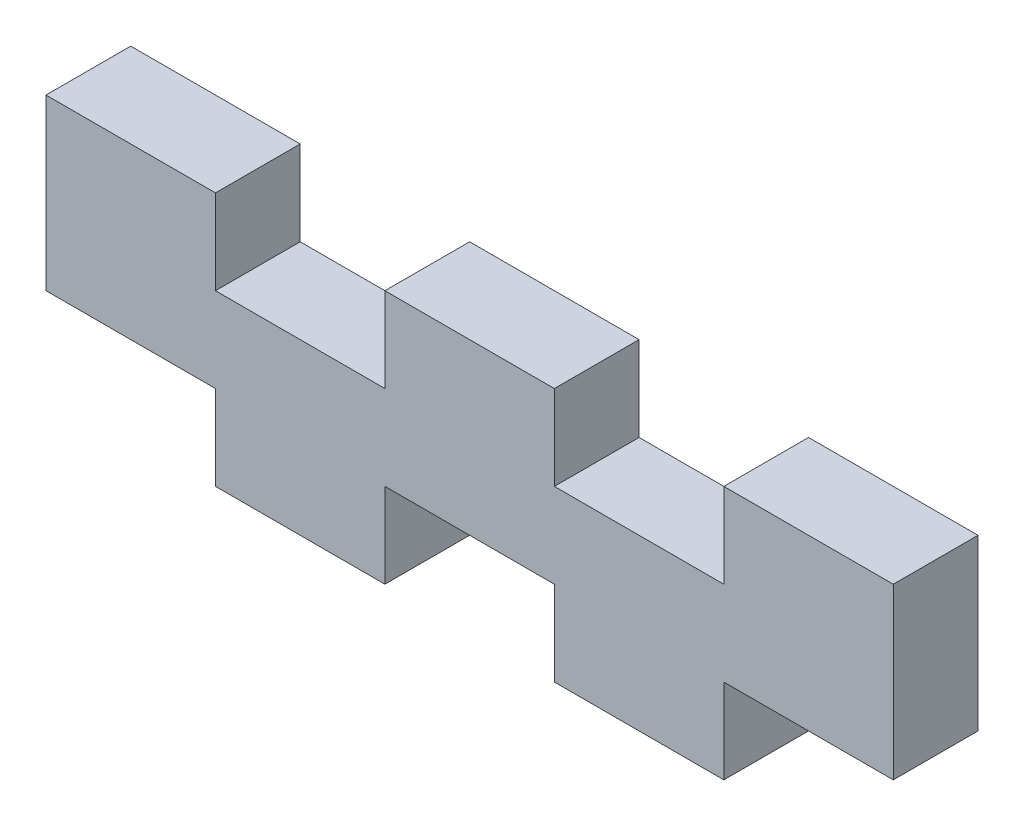
ISO-10303-21;
HEADER;
FILE_DESCRIPTION(('STEP AP214'),'2;1');
FILE_NAME('part.step','',(''),(''),'','','');
FILE_SCHEMA(('AUTOMOTIVE_DESIGN { 1 0 10303 214 1 1 1 1 }'));
ENDSEC;
DATA;
#1=APPLICATION_CONTEXT('core data for automotive mechanical design processes');
#2=APPLICATION_PROTOCOL_DEFINITION('international standard','automotive_design',2000,#1);
#3=PRODUCT_CONTEXT('',#1,'mechanical');
#4=PRODUCT('Part','Part','',(#3));
#5=PRODUCT_RELATED_PRODUCT_CATEGORY('part','',(#4));
#6=PRODUCT_DEFINITION_FORMATION('','',#4);
#7=PRODUCT_DEFINITION_CONTEXT('part definition',#1,'design');
#8=PRODUCT_DEFINITION('design','',#6,#7);
#9=PRODUCT_DEFINITION_SHAPE('','',#8);
#10=(LENGTH_UNIT() NAMED_UNIT(*) SI_UNIT(.MILLI.,.METRE.));
#11=(NAMED_UNIT(*) PLANE_ANGLE_UNIT() SI_UNIT($,.RADIAN.));
#12=(NAMED_UNIT(*) SI_UNIT($,.STERADIAN.) SOLID_ANGLE_UNIT());
#13=UNCERTAINTY_MEASURE_WITH_UNIT(LENGTH_MEASURE(1.E-05),#10,'distance_accuracy_value','');
#14=(GEOMETRIC_REPRESENTATION_CONTEXT(3) GLOBAL_UNCERTAINTY_ASSIGNED_CONTEXT((#13)) GLOBAL_UNIT_ASSIGNED_CONTEXT((#10,
#11,#12)) REPRESENTATION_CONTEXT('',''));
#15=CARTESIAN_POINT('',(0.,0.,0.));
#16=DIRECTION('',(0.,0.,1.));
#17=DIRECTION('',(1.,0.,0.));
#18=AXIS2_PLACEMENT_3D('',#15,#16,#17);
#19=CARTESIAN_POINT('',(0.,15.24,5.08000000000031));
#20=DIRECTION('',(0.,-1.,0.));
#21=DIRECTION('',(1.00000000000002,0.,0.));
#22=AXIS2_PLACEMENT_3D('',#19,#20,#21);
#23=PLANE('',#22);
#24=DIRECTION('',(-1.00000000000002,0.,0.));
#25=VECTOR('',#24,1.);
#26=CARTESIAN_POINT('',(0.,15.24,5.08000000000031));
#27=LINE('',#26,#25);
#28=CARTESIAN_POINT('',(10.1600000000002,15.24,5.0800000000002));
#29=VERTEX_POINT('',#28);
#30=CARTESIAN_POINT('',(0.,15.24,5.08000000000031));
#31=VERTEX_POINT('',#30);
#32=EDGE_CURVE('E212',#29,#31,#27,.T.);
#33=ORIENTED_EDGE('',*,*,#32,.F.);
#34=DIRECTION('',(0.,0.,1.00000000000002));
#35=VECTOR('',#34,1.);
#36=CARTESIAN_POINT('',(10.1600000000002,15.24,-0.000999999999862222));
#37=LINE('',#36,#35);
#38=CARTESIAN_POINT('',(10.1600000000002,15.24,2.22044604925031E-13));
#39=VERTEX_POINT('',#38);
#40=EDGE_CURVE('E179',#39,#29,#37,.T.);
#41=ORIENTED_EDGE('',*,*,#40,.F.);
#42=DIRECTION('',(-1.00000000000002,0.,0.));
#43=VECTOR('',#42,1.);
#44=CARTESIAN_POINT('',(0.,15.24,0.));
#45=LINE('',#44,#43);
#46=CARTESIAN_POINT('',(0.,15.24,0.));
#47=VERTEX_POINT('',#46);
#48=EDGE_CURVE('E195',#39,#47,#45,.T.);
#49=ORIENTED_EDGE('',*,*,#48,.T.);
#50=DIRECTION('',(0.,0.,-1.00000000000002));
#51=VECTOR('',#50,1.);
#52=CARTESIAN_POINT('',(0.,15.24,5.08000000000031));
#53=LINE('',#52,#51);
#54=EDGE_CURVE('E40',#31,#47,#53,.T.);
#55=ORIENTED_EDGE('',*,*,#54,.F.);
#56=EDGE_LOOP('',(#33,#41,#49,#55));
#57=FACE_BOUND('',#56,.T.);
#58=ADVANCED_FACE('F32',(#57),#23,.F.);
#59=CARTESIAN_POINT('',(30.4800000000005,15.2399999999999,1.94289029309402E-13));
#60=VERTEX_POINT('',#59);
#61=CARTESIAN_POINT('',(20.3200000000003,15.24,1.11022302462516E-13));
#62=VERTEX_POINT('',#61);
#63=EDGE_CURVE('E186',#60,#62,#45,.T.);
#64=ORIENTED_EDGE('',*,*,#63,.T.);
#65=DIRECTION('',(0.,0.,1.00000000000002));
#66=VECTOR('',#65,1.);
#67=CARTESIAN_POINT('',(20.3200000000003,15.24,-0.000999999999806711));
#68=LINE('',#67,#66);
#69=CARTESIAN_POINT('',(20.3200000000003,15.24,5.08000000000028));
#70=VERTEX_POINT('',#69);
#71=EDGE_CURVE('E168',#62,#70,#68,.T.);
#72=ORIENTED_EDGE('',*,*,#71,.T.);
#73=CARTESIAN_POINT('',(30.4800000000005,15.24,5.08000000000029));
#74=VERTEX_POINT('',#73);
#75=EDGE_CURVE('E210',#74,#70,#27,.T.);
#76=ORIENTED_EDGE('',*,*,#75,.F.);
#77=DIRECTION('',(0.,0.,1.00000000000002));
#78=VECTOR('',#77,1.);
#79=CARTESIAN_POINT('',(30.4800000000005,15.2399999999999,-0.001000000000001));
#80=LINE('',#79,#78);
#81=EDGE_CURVE('E193',#60,#74,#80,.T.);
#82=ORIENTED_EDGE('',*,*,#81,.F.);
#83=EDGE_LOOP('',(#64,#72,#76,#82));
#84=FACE_BOUND('',#83,.T.);
#85=ADVANCED_FACE('F192',(#84),#23,.F.);
#86=CARTESIAN_POINT('',(0.,0.,5.08000000000028));
#87=DIRECTION('',(0.,1.,0.));
#88=DIRECTION('',(0.,0.,1.00000000000002));
#89=AXIS2_PLACEMENT_3D('',#86,#87,#88);
#90=PLANE('',#89);
#91=DIRECTION('',(1.00000000000002,0.,0.));
#92=VECTOR('',#91,1.);
#93=CARTESIAN_POINT('',(0.,0.,5.08000000000028));
#94=LINE('',#93,#92);
#95=CARTESIAN_POINT('',(10.1600000000001,0.,5.08000000000006));
#96=VERTEX_POINT('',#95);
#97=CARTESIAN_POINT('',(20.3200000000004,0.,5.08000000000017));
#98=VERTEX_POINT('',#97);
#99=EDGE_CURVE('E222',#96,#98,#94,.T.);
#100=ORIENTED_EDGE('',*,*,#99,.F.);
#101=DIRECTION('',(0.,0.,-1.00000000000002));
#102=VECTOR('',#101,1.);
#103=CARTESIAN_POINT('',(10.1600000000002,0.,5.08100000000027));
#104=LINE('',#103,#102);
#105=CARTESIAN_POINT('',(10.1600000000002,0.,1.38777878078145E-13));
#106=VERTEX_POINT('',#105);
#107=EDGE_CURVE('E278',#96,#106,#104,.T.);
#108=ORIENTED_EDGE('',*,*,#107,.T.);
#109=DIRECTION('',(1.00000000000002,0.,0.));
#110=VECTOR('',#109,1.);
#111=CARTESIAN_POINT('',(0.,0.,0.));
#112=LINE('',#111,#110);
#113=CARTESIAN_POINT('',(20.3200000000004,0.,1.94289029309402E-13));
#114=VERTEX_POINT('',#113);
#115=EDGE_CURVE('E347',#106,#114,#112,.T.);
#116=ORIENTED_EDGE('',*,*,#115,.T.);
#117=DIRECTION('',(0.,0.,-1.00000000000002));
#118=VECTOR('',#117,1.);
#119=CARTESIAN_POINT('',(20.3200000000004,0.,5.08100000000014));
#120=LINE('',#119,#118);
#121=EDGE_CURVE('E254',#98,#114,#120,.T.);
#122=ORIENTED_EDGE('',*,*,#121,.F.);
#123=EDGE_LOOP('',(#100,#108,#116,#122));
#124=FACE_BOUND('',#123,.T.);
#125=ADVANCED_FACE('F345',(#124),#90,.F.);
#126=CARTESIAN_POINT('',(0.,0.,5.08000000000028));
#127=DIRECTION('',(1.00000000000002,0.,0.));
#128=DIRECTION('',(0.,0.,-1.00000000000002));
#129=AXIS2_PLACEMENT_3D('',#126,#127,#128);
#130=PLANE('',#129);
#131=DIRECTION('',(0.,-1.,0.));
#132=VECTOR('',#131,1.);
#133=CARTESIAN_POINT('',(0.,0.,0.));
#134=LINE('',#133,#132);
#135=CARTESIAN_POINT('',(0.,5.08,0.));
#136=VERTEX_POINT('',#135);
#137=EDGE_CURVE('E277',#47,#136,#134,.T.);
#138=ORIENTED_EDGE('',*,*,#137,.T.);
#139=DIRECTION('',(0.,0.,-1.00000000000002));
#140=VECTOR('',#139,1.);
#141=CARTESIAN_POINT('',(0.,5.08,5.08100000000028));
#142=LINE('',#141,#140);
#143=CARTESIAN_POINT('',(0.,5.08,5.08000000000028));
#144=VERTEX_POINT('',#143);
#145=EDGE_CURVE('E279',#144,#136,#142,.T.);
#146=ORIENTED_EDGE('',*,*,#145,.F.);
#147=DIRECTION('',(0.,-1.,0.));
#148=VECTOR('',#147,1.);
#149=CARTESIAN_POINT('',(0.,0.,5.08000000000028));
#150=LINE('',#149,#148);
#151=EDGE_CURVE('E198',#31,#144,#150,.T.);
#152=ORIENTED_EDGE('',*,*,#151,.F.);
#153=ORIENTED_EDGE('',*,*,#54,.T.);
#154=EDGE_LOOP('',(#138,#146,#152,#153));
#155=FACE_BOUND('',#154,.T.);
#156=ADVANCED_FACE('F34',(#155),#130,.F.);
#157=CARTESIAN_POINT('',(30.4800000000005,0.,5.0800000000002));
#158=VERTEX_POINT('',#157);
#159=CARTESIAN_POINT('',(40.6400000000007,0.,5.08000000000028));
#160=VERTEX_POINT('',#159);
#161=EDGE_CURVE('E227',#158,#160,#94,.T.);
#162=ORIENTED_EDGE('',*,*,#161,.F.);
#163=DIRECTION('',(0.,0.,-1.00000000000002));
#164=VECTOR('',#163,1.);
#165=CARTESIAN_POINT('',(30.4800000000006,0.,5.08100000000022));
#166=LINE('',#165,#164);
#167=CARTESIAN_POINT('',(30.4800000000005,0.,2.77555756156289E-13));
#168=VERTEX_POINT('',#167);
#169=EDGE_CURVE('E261',#158,#168,#166,.T.);
#170=ORIENTED_EDGE('',*,*,#169,.T.);
#171=CARTESIAN_POINT('',(40.6400000000007,0.,1.66533453693773E-13));
#172=VERTEX_POINT('',#171);
#173=EDGE_CURVE('E350',#168,#172,#112,.T.);
#174=ORIENTED_EDGE('',*,*,#173,.T.);
#175=DIRECTION('',(0.,0.,-1.00000000000002));
#176=VECTOR('',#175,1.);
#177=CARTESIAN_POINT('',(40.6400000000007,0.,5.08100000000022));
#178=LINE('',#177,#176);
#179=EDGE_CURVE('E232',#160,#172,#178,.T.);
#180=ORIENTED_EDGE('',*,*,#179,.F.);
#181=EDGE_LOOP('',(#162,#170,#174,#180));
#182=FACE_BOUND('',#181,.T.);
#183=ADVANCED_FACE('F356',(#182),#90,.F.);
#184=CARTESIAN_POINT('',(50.800000000001,0.,5.08000000000028));
#185=DIRECTION('',(-1.00000000000002,0.,0.));
#186=DIRECTION('',(0.,0.,1.00000000000002));
#187=AXIS2_PLACEMENT_3D('',#184,#185,#186);
#188=PLANE('',#187);
#189=DIRECTION('',(0.,1.,0.));
#190=VECTOR('',#189,1.);
#191=CARTESIAN_POINT('',(50.800000000001,0.,5.08000000000028));
#192=LINE('',#191,#190);
#193=CARTESIAN_POINT('',(50.800000000001,5.08000000000006,5.08000000000028));
#194=VERTEX_POINT('',#193);
#195=CARTESIAN_POINT('',(50.8000000000009,15.24,5.08000000000031));
#196=VERTEX_POINT('',#195);
#197=EDGE_CURVE('E218',#194,#196,#192,.T.);
#198=ORIENTED_EDGE('',*,*,#197,.F.);
#199=DIRECTION('',(0.,0.,-1.00000000000002));
#200=VECTOR('',#199,1.);
#201=CARTESIAN_POINT('',(50.8000000000009,5.08000000000006,5.0810000000002));
#202=LINE('',#201,#200);
#203=CARTESIAN_POINT('',(50.8000000000009,5.08000000000006,1.80411241501588E-13));
#204=VERTEX_POINT('',#203);
#205=EDGE_CURVE('E237',#194,#204,#202,.T.);
#206=ORIENTED_EDGE('',*,*,#205,.T.);
#207=DIRECTION('',(0.,1.,0.));
#208=VECTOR('',#207,1.);
#209=CARTESIAN_POINT('',(50.8000000000009,0.,1.80411241501588E-13));
#210=LINE('',#209,#208);
#211=CARTESIAN_POINT('',(50.8000000000008,15.24,1.11022302462516E-13));
#212=VERTEX_POINT('',#211);
#213=EDGE_CURVE('E199',#204,#212,#210,.T.);
#214=ORIENTED_EDGE('',*,*,#213,.T.);
#215=DIRECTION('',(0.,0.,-1.00000000000002));
#216=VECTOR('',#215,1.);
#217=CARTESIAN_POINT('',(50.8000000000009,15.24,5.08000000000031));
#218=LINE('',#217,#216);
#219=EDGE_CURVE('E11',#196,#212,#218,.T.);
#220=ORIENTED_EDGE('',*,*,#219,.F.);
#221=EDGE_LOOP('',(#198,#206,#214,#220));
#222=FACE_BOUND('',#221,.T.);
#223=ADVANCED_FACE('F393',(#222),#188,.F.);
#224=CARTESIAN_POINT('',(40.6400000000006,15.24,1.11022302462516E-13));
#225=VERTEX_POINT('',#224);
#226=EDGE_CURVE('E194',#212,#225,#45,.T.);
#227=ORIENTED_EDGE('',*,*,#226,.T.);
#228=DIRECTION('',(0.,0.,1.00000000000002));
#229=VECTOR('',#228,1.);
#230=CARTESIAN_POINT('',(40.6400000000007,15.24,-0.000999999999862222));
#231=LINE('',#230,#229);
#232=CARTESIAN_POINT('',(40.6400000000006,15.24,5.0800000000002));
#233=VERTEX_POINT('',#232);
#234=EDGE_CURVE('E298',#225,#233,#231,.T.);
#235=ORIENTED_EDGE('',*,*,#234,.T.);
#236=EDGE_CURVE('E203',#196,#233,#27,.T.);
#237=ORIENTED_EDGE('',*,*,#236,.F.);
#238=ORIENTED_EDGE('',*,*,#219,.T.);
#239=EDGE_LOOP('',(#227,#235,#237,#238));
#240=FACE_BOUND('',#239,.T.);
#241=ADVANCED_FACE('F386',(#240),#23,.F.);
#242=CARTESIAN_POINT('',(0.,0.,5.08000000000028));
#243=DIRECTION('',(0.,0.,-1.00000000000002));
#244=DIRECTION('',(-1.00000000000002,0.,0.));
#245=AXIS2_PLACEMENT_3D('',#242,#243,#244);
#246=PLANE('',#245);
#247=DIRECTION('',(1.00000000000002,0.,0.));
#248=VECTOR('',#247,1.);
#249=CARTESIAN_POINT('',(10.1600000000002,10.1599999999999,5.08000000000021));
#250=LINE('',#249,#248);
#251=CARTESIAN_POINT('',(10.1600000000002,10.1599999999999,5.08000000000021));
#252=VERTEX_POINT('',#251);
#253=CARTESIAN_POINT('',(20.3200000000004,10.16,5.08000000000024));
#254=VERTEX_POINT('',#253);
#255=EDGE_CURVE('E319',#252,#254,#250,.T.);
#256=ORIENTED_EDGE('',*,*,#255,.F.);
#257=DIRECTION('',(0.,-1.,0.));
#258=VECTOR('',#257,1.);
#259=CARTESIAN_POINT('',(10.1600000000002,15.24,5.0800000000002));
#260=LINE('',#259,#258);
#261=EDGE_CURVE('E321',#29,#252,#260,.T.);
#262=ORIENTED_EDGE('',*,*,#261,.F.);
#263=ORIENTED_EDGE('',*,*,#32,.T.);
#264=ORIENTED_EDGE('',*,*,#151,.T.);
#265=DIRECTION('',(-1.00000000000002,0.,0.));
#266=VECTOR('',#265,1.);
#267=CARTESIAN_POINT('',(0.,5.08,5.08000000000028));
#268=LINE('',#267,#266);
#269=CARTESIAN_POINT('',(10.1600000000001,5.08,5.08000000000014));
#270=VERTEX_POINT('',#269);
#271=EDGE_CURVE('E275',#270,#144,#268,.T.);
#272=ORIENTED_EDGE('',*,*,#271,.F.);
#273=DIRECTION('',(0.,1.,0.));
#274=VECTOR('',#273,1.);
#275=CARTESIAN_POINT('',(10.1600000000001,0.,5.08000000000006));
#276=LINE('',#275,#274);
#277=EDGE_CURVE('E253',#96,#270,#276,.T.);
#278=ORIENTED_EDGE('',*,*,#277,.F.);
#279=ORIENTED_EDGE('',*,*,#99,.T.);
#280=DIRECTION('',(0.,-1.,0.));
#281=VECTOR('',#280,1.);
#282=CARTESIAN_POINT('',(20.3200000000004,0.,5.08000000000017));
#283=LINE('',#282,#281);
#284=CARTESIAN_POINT('',(20.3200000000003,5.08,5.08000000000017));
#285=VERTEX_POINT('',#284);
#286=EDGE_CURVE('E271',#285,#98,#283,.T.);
#287=ORIENTED_EDGE('',*,*,#286,.F.);
#288=DIRECTION('',(-1.00000000000002,0.,0.));
#289=VECTOR('',#288,1.);
#290=CARTESIAN_POINT('',(20.3200000000003,5.08,5.08000000000017));
#291=LINE('',#290,#289);
#292=CARTESIAN_POINT('',(30.4800000000005,5.08000000000006,5.0800000000002));
#293=VERTEX_POINT('',#292);
#294=EDGE_CURVE('E250',#293,#285,#291,.T.);
#295=ORIENTED_EDGE('',*,*,#294,.F.);
#296=DIRECTION('',(0.,1.,0.));
#297=VECTOR('',#296,1.);
#298=CARTESIAN_POINT('',(30.4800000000005,0.,5.0800000000002));
#299=LINE('',#298,#297);
#300=EDGE_CURVE('E240',#158,#293,#299,.T.);
#301=ORIENTED_EDGE('',*,*,#300,.F.);
#302=ORIENTED_EDGE('',*,*,#161,.T.);
#303=DIRECTION('',(0.,-1.,0.));
#304=VECTOR('',#303,1.);
#305=CARTESIAN_POINT('',(40.6400000000007,0.,5.08000000000028));
#306=LINE('',#305,#304);
#307=CARTESIAN_POINT('',(40.6400000000007,5.07999999999999,5.08000000000028));
#308=VERTEX_POINT('',#307);
#309=EDGE_CURVE('E248',#308,#160,#306,.T.);
#310=ORIENTED_EDGE('',*,*,#309,.F.);
#311=DIRECTION('',(-1.00000000000002,0.,0.));
#312=VECTOR('',#311,1.);
#313=CARTESIAN_POINT('',(50.800000000001,5.08000000000006,5.08000000000028));
#314=LINE('',#313,#312);
#315=EDGE_CURVE('E245',#194,#308,#314,.T.);
#316=ORIENTED_EDGE('',*,*,#315,.F.);
#317=ORIENTED_EDGE('',*,*,#197,.T.);
#318=ORIENTED_EDGE('',*,*,#236,.T.);
#319=DIRECTION('',(0.,1.,0.));
#320=VECTOR('',#319,1.);
#321=CARTESIAN_POINT('',(40.6400000000006,15.24,5.0800000000002));
#322=LINE('',#321,#320);
#323=CARTESIAN_POINT('',(40.6400000000006,10.16,5.0800000000002));
#324=VERTEX_POINT('',#323);
#325=EDGE_CURVE('E296',#324,#233,#322,.T.);
#326=ORIENTED_EDGE('',*,*,#325,.F.);
#327=DIRECTION('',(1.00000000000002,0.,0.));
#328=VECTOR('',#327,1.);
#329=CARTESIAN_POINT('',(30.4800000000006,10.16,5.08000000000025));
#330=LINE('',#329,#328);
#331=CARTESIAN_POINT('',(30.4800000000006,10.16,5.08000000000025));
#332=VERTEX_POINT('',#331);
#333=EDGE_CURVE('E303',#332,#324,#330,.T.);
#334=ORIENTED_EDGE('',*,*,#333,.F.);
#335=DIRECTION('',(0.,-1.,0.));
#336=VECTOR('',#335,1.);
#337=CARTESIAN_POINT('',(30.4800000000005,15.24,5.08000000000029));
#338=LINE('',#337,#336);
#339=EDGE_CURVE('E305',#74,#332,#338,.T.);
#340=ORIENTED_EDGE('',*,*,#339,.F.);
#341=ORIENTED_EDGE('',*,*,#75,.T.);
#342=DIRECTION('',(0.,1.,0.));
#343=VECTOR('',#342,1.);
#344=CARTESIAN_POINT('',(20.3200000000003,15.24,5.08000000000028));
#345=LINE('',#344,#343);
#346=EDGE_CURVE('E174',#254,#70,#345,.T.);
#347=ORIENTED_EDGE('',*,*,#346,.F.);
#348=EDGE_LOOP('',(#256,#262,#263,#264,#272,#278,#279,#287,#295,#301,#302,#310,#316,#317,#318,
#326,#334,#340,#341,#347));
#349=FACE_BOUND('',#348,.T.);
#350=ADVANCED_FACE('F333',(#349),#246,.F.);
#351=CARTESIAN_POINT('',(0.,0.,0.));
#352=DIRECTION('',(0.,0.,-1.00000000000002));
#353=DIRECTION('',(-1.00000000000002,0.,0.));
#354=AXIS2_PLACEMENT_3D('',#351,#352,#353);
#355=PLANE('',#354);
#356=DIRECTION('',(0.,-1.,0.));
#357=VECTOR('',#356,1.);
#358=CARTESIAN_POINT('',(10.1600000000002,15.24,2.22044604925031E-13));
#359=LINE('',#358,#357);
#360=CARTESIAN_POINT('',(10.1600000000001,10.16,0.));
#361=VERTEX_POINT('',#360);
#362=EDGE_CURVE('E188',#39,#361,#359,.T.);
#363=ORIENTED_EDGE('',*,*,#362,.T.);
#364=DIRECTION('',(1.00000000000002,0.,0.));
#365=VECTOR('',#364,1.);
#366=CARTESIAN_POINT('',(10.1600000000001,10.16,0.));
#367=LINE('',#366,#365);
#368=CARTESIAN_POINT('',(20.3200000000004,10.16,1.94289029309402E-13));
#369=VERTEX_POINT('',#368);
#370=EDGE_CURVE('E187',#361,#369,#367,.T.);
#371=ORIENTED_EDGE('',*,*,#370,.T.);
#372=DIRECTION('',(0.,1.,0.));
#373=VECTOR('',#372,1.);
#374=CARTESIAN_POINT('',(20.3200000000003,15.24,1.11022302462516E-13));
#375=LINE('',#374,#373);
#376=EDGE_CURVE('E171',#369,#62,#375,.T.);
#377=ORIENTED_EDGE('',*,*,#376,.T.);
#378=ORIENTED_EDGE('',*,*,#63,.F.);
#379=DIRECTION('',(0.,-1.,0.));
#380=VECTOR('',#379,1.);
#381=CARTESIAN_POINT('',(30.4800000000005,15.2399999999999,1.94289029309402E-13));
#382=LINE('',#381,#380);
#383=CARTESIAN_POINT('',(30.4800000000005,10.1600000000001,1.94289029309402E-13));
#384=VERTEX_POINT('',#383);
#385=EDGE_CURVE('E308',#60,#384,#382,.T.);
#386=ORIENTED_EDGE('',*,*,#385,.T.);
#387=DIRECTION('',(1.00000000000002,0.,0.));
#388=VECTOR('',#387,1.);
#389=CARTESIAN_POINT('',(30.4800000000005,10.1600000000001,1.94289029309402E-13));
#390=LINE('',#389,#388);
#391=CARTESIAN_POINT('',(40.6400000000006,10.16,1.11022302462516E-13));
#392=VERTEX_POINT('',#391);
#393=EDGE_CURVE('E189',#384,#392,#390,.T.);
#394=ORIENTED_EDGE('',*,*,#393,.T.);
#395=DIRECTION('',(0.,1.,0.));
#396=VECTOR('',#395,1.);
#397=CARTESIAN_POINT('',(40.6400000000006,15.24,1.11022302462516E-13));
#398=LINE('',#397,#396);
#399=EDGE_CURVE('E310',#392,#225,#398,.T.);
#400=ORIENTED_EDGE('',*,*,#399,.T.);
#401=ORIENTED_EDGE('',*,*,#226,.F.);
#402=ORIENTED_EDGE('',*,*,#213,.F.);
#403=DIRECTION('',(1.00000000000002,0.,0.));
#404=VECTOR('',#403,1.);
#405=CARTESIAN_POINT('',(50.8000000000009,5.08000000000006,1.80411241501588E-13));
#406=LINE('',#405,#404);
#407=CARTESIAN_POINT('',(40.6400000000007,5.07999999999999,1.66533453693773E-13));
#408=VERTEX_POINT('',#407);
#409=EDGE_CURVE('E235',#408,#204,#406,.T.);
#410=ORIENTED_EDGE('',*,*,#409,.F.);
#411=DIRECTION('',(0.,1.,0.));
#412=VECTOR('',#411,1.);
#413=CARTESIAN_POINT('',(40.6400000000007,0.,1.66533453693773E-13));
#414=LINE('',#413,#412);
#415=EDGE_CURVE('E242',#172,#408,#414,.T.);
#416=ORIENTED_EDGE('',*,*,#415,.F.);
#417=ORIENTED_EDGE('',*,*,#173,.F.);
#418=DIRECTION('',(0.,-1.,0.));
#419=VECTOR('',#418,1.);
#420=CARTESIAN_POINT('',(30.4800000000005,0.,2.77555756156289E-13));
#421=LINE('',#420,#419);
#422=CARTESIAN_POINT('',(30.4800000000005,5.08000000000006,2.77555756156289E-13));
#423=VERTEX_POINT('',#422);
#424=EDGE_CURVE('E259',#423,#168,#421,.T.);
#425=ORIENTED_EDGE('',*,*,#424,.F.);
#426=DIRECTION('',(1.00000000000002,0.,0.));
#427=VECTOR('',#426,1.);
#428=CARTESIAN_POINT('',(20.3200000000004,5.08,1.66533453693773E-13));
#429=LINE('',#428,#427);
#430=CARTESIAN_POINT('',(20.3200000000004,5.08,1.66533453693773E-13));
#431=VERTEX_POINT('',#430);
#432=EDGE_CURVE('E266',#431,#423,#429,.T.);
#433=ORIENTED_EDGE('',*,*,#432,.F.);
#434=DIRECTION('',(0.,1.,0.));
#435=VECTOR('',#434,1.);
#436=CARTESIAN_POINT('',(20.3200000000004,0.,1.94289029309402E-13));
#437=LINE('',#436,#435);
#438=EDGE_CURVE('E269',#114,#431,#437,.T.);
#439=ORIENTED_EDGE('',*,*,#438,.F.);
#440=ORIENTED_EDGE('',*,*,#115,.F.);
#441=DIRECTION('',(0.,-1.,0.));
#442=VECTOR('',#441,1.);
#443=CARTESIAN_POINT('',(10.1600000000002,0.,1.38777878078145E-13));
#444=LINE('',#443,#442);
#445=CARTESIAN_POINT('',(10.1600000000001,5.08,0.));
#446=VERTEX_POINT('',#445);
#447=EDGE_CURVE('E282',#446,#106,#444,.T.);
#448=ORIENTED_EDGE('',*,*,#447,.F.);
#449=DIRECTION('',(1.00000000000002,0.,0.));
#450=VECTOR('',#449,1.);
#451=CARTESIAN_POINT('',(0.,5.08,0.));
#452=LINE('',#451,#450);
#453=EDGE_CURVE('E287',#136,#446,#452,.T.);
#454=ORIENTED_EDGE('',*,*,#453,.F.);
#455=ORIENTED_EDGE('',*,*,#137,.F.);
#456=ORIENTED_EDGE('',*,*,#48,.F.);
#457=EDGE_LOOP('',(#363,#371,#377,#378,#386,#394,#400,#401,#402,#410,#416,#417,#425,#433,#439,
#440,#448,#454,#455,#456));
#458=FACE_BOUND('',#457,.T.);
#459=ADVANCED_FACE('F184',(#458),#355,.T.);
#460=CARTESIAN_POINT('',(50.8000000000009,5.08000000000006,5.0810000000002));
#461=DIRECTION('',(0.,1.,0.));
#462=DIRECTION('',(-1.00000000000002,0.,0.));
#463=AXIS2_PLACEMENT_3D('',#460,#461,#462);
#464=PLANE('',#463);
#465=ORIENTED_EDGE('',*,*,#315,.T.);
#466=DIRECTION('',(0.,0.,-1.00000000000002));
#467=VECTOR('',#466,1.);
#468=CARTESIAN_POINT('',(40.6400000000007,5.07999999999999,5.08100000000022));
#469=LINE('',#468,#467);
#470=EDGE_CURVE('E234',#308,#408,#469,.T.);
#471=ORIENTED_EDGE('',*,*,#470,.T.);
#472=ORIENTED_EDGE('',*,*,#409,.T.);
#473=ORIENTED_EDGE('',*,*,#205,.F.);
#474=EDGE_LOOP('',(#465,#471,#472,#473));
#475=FACE_BOUND('',#474,.T.);
#476=ADVANCED_FACE('F380',(#475),#464,.F.);
#477=CARTESIAN_POINT('',(40.6400000000007,0.,5.08100000000022));
#478=DIRECTION('',(-1.00000000000002,0.,0.));
#479=DIRECTION('',(0.,0.,1.00000000000002));
#480=AXIS2_PLACEMENT_3D('',#477,#478,#479);
#481=PLANE('',#480);
#482=ORIENTED_EDGE('',*,*,#309,.T.);
#483=ORIENTED_EDGE('',*,*,#179,.T.);
#484=ORIENTED_EDGE('',*,*,#415,.T.);
#485=ORIENTED_EDGE('',*,*,#470,.F.);
#486=EDGE_LOOP('',(#482,#483,#484,#485));
#487=FACE_BOUND('',#486,.T.);
#488=ADVANCED_FACE('F362',(#487),#481,.F.);
#489=CARTESIAN_POINT('',(20.3200000000004,0.,5.08100000000014));
#490=DIRECTION('',(-1.00000000000002,0.,0.));
#491=DIRECTION('',(0.,0.,1.00000000000002));
#492=AXIS2_PLACEMENT_3D('',#489,#490,#491);
#493=PLANE('',#492);
#494=ORIENTED_EDGE('',*,*,#286,.T.);
#495=ORIENTED_EDGE('',*,*,#121,.T.);
#496=ORIENTED_EDGE('',*,*,#438,.T.);
#497=DIRECTION('',(0.,0.,-1.00000000000002));
#498=VECTOR('',#497,1.);
#499=CARTESIAN_POINT('',(20.3200000000004,5.08,5.08100000000025));
#500=LINE('',#499,#498);
#501=EDGE_CURVE('E255',#285,#431,#500,.T.);
#502=ORIENTED_EDGE('',*,*,#501,.F.);
#503=EDGE_LOOP('',(#494,#495,#496,#502));
#504=FACE_BOUND('',#503,.T.);
#505=ADVANCED_FACE('F372',(#504),#493,.F.);
#506=CARTESIAN_POINT('',(30.4800000000006,0.,5.08100000000022));
#507=DIRECTION('',(1.00000000000002,0.,0.));
#508=DIRECTION('',(0.,0.,-1.00000000000002));
#509=AXIS2_PLACEMENT_3D('',#506,#507,#508);
#510=PLANE('',#509);
#511=ORIENTED_EDGE('',*,*,#300,.T.);
#512=DIRECTION('',(0.,0.,-1.00000000000002));
#513=VECTOR('',#512,1.);
#514=CARTESIAN_POINT('',(30.4800000000005,5.08000000000006,5.08100000000022));
#515=LINE('',#514,#513);
#516=EDGE_CURVE('E258',#293,#423,#515,.T.);
#517=ORIENTED_EDGE('',*,*,#516,.T.);
#518=ORIENTED_EDGE('',*,*,#424,.T.);
#519=ORIENTED_EDGE('',*,*,#169,.F.);
#520=EDGE_LOOP('',(#511,#517,#518,#519));
#521=FACE_BOUND('',#520,.T.);
#522=ADVANCED_FACE('F368',(#521),#510,.F.);
#523=CARTESIAN_POINT('',(20.3200000000004,5.08,5.08100000000025));
#524=DIRECTION('',(0.,1.,0.));
#525=DIRECTION('',(-1.00000000000002,0.,0.));
#526=AXIS2_PLACEMENT_3D('',#523,#524,#525);
#527=PLANE('',#526);
#528=ORIENTED_EDGE('',*,*,#294,.T.);
#529=ORIENTED_EDGE('',*,*,#501,.T.);
#530=ORIENTED_EDGE('',*,*,#432,.T.);
#531=ORIENTED_EDGE('',*,*,#516,.F.);
#532=EDGE_LOOP('',(#528,#529,#530,#531));
#533=FACE_BOUND('',#532,.T.);
#534=ADVANCED_FACE('F370',(#533),#527,.F.);
#535=CARTESIAN_POINT('',(10.1600000000002,0.,5.08100000000027));
#536=DIRECTION('',(1.00000000000002,0.,0.));
#537=DIRECTION('',(0.,0.,-1.00000000000002));
#538=AXIS2_PLACEMENT_3D('',#535,#536,#537);
#539=PLANE('',#538);
#540=ORIENTED_EDGE('',*,*,#277,.T.);
#541=DIRECTION('',(0.,0.,-1.00000000000002));
#542=VECTOR('',#541,1.);
#543=CARTESIAN_POINT('',(10.1600000000002,5.08,5.08100000000024));
#544=LINE('',#543,#542);
#545=EDGE_CURVE('E281',#270,#446,#544,.T.);
#546=ORIENTED_EDGE('',*,*,#545,.T.);
#547=ORIENTED_EDGE('',*,*,#447,.T.);
#548=ORIENTED_EDGE('',*,*,#107,.F.);
#549=EDGE_LOOP('',(#540,#546,#547,#548));
#550=FACE_BOUND('',#549,.T.);
#551=ADVANCED_FACE('F341',(#550),#539,.F.);
#552=CARTESIAN_POINT('',(0.,5.08,5.08100000000028));
#553=DIRECTION('',(0.,1.,0.));
#554=DIRECTION('',(-1.00000000000002,0.,0.));
#555=AXIS2_PLACEMENT_3D('',#552,#553,#554);
#556=PLANE('',#555);
#557=ORIENTED_EDGE('',*,*,#271,.T.);
#558=ORIENTED_EDGE('',*,*,#145,.T.);
#559=ORIENTED_EDGE('',*,*,#453,.T.);
#560=ORIENTED_EDGE('',*,*,#545,.F.);
#561=EDGE_LOOP('',(#557,#558,#559,#560));
#562=FACE_BOUND('',#561,.T.);
#563=ADVANCED_FACE('F337',(#562),#556,.F.);
#564=CARTESIAN_POINT('',(30.4800000000005,15.2399999999999,-0.001000000000001));
#565=DIRECTION('',(-1.00000000000002,0.,0.));
#566=DIRECTION('',(0.,0.,1.00000000000002));
#567=AXIS2_PLACEMENT_3D('',#564,#565,#566);
#568=PLANE('',#567);
#569=ORIENTED_EDGE('',*,*,#81,.T.);
#570=ORIENTED_EDGE('',*,*,#339,.T.);
#571=DIRECTION('',(0.,0.,1.00000000000002));
#572=VECTOR('',#571,1.);
#573=CARTESIAN_POINT('',(30.4800000000005,10.1600000000001,-0.001000000000001));
#574=LINE('',#573,#572);
#575=EDGE_CURVE('E294',#384,#332,#574,.T.);
#576=ORIENTED_EDGE('',*,*,#575,.F.);
#577=ORIENTED_EDGE('',*,*,#385,.F.);
#578=EDGE_LOOP('',(#569,#570,#576,#577));
#579=FACE_BOUND('',#578,.T.);
#580=ADVANCED_FACE('F409',(#579),#568,.F.);
#581=CARTESIAN_POINT('',(40.6400000000007,15.24,-0.000999999999862222));
#582=DIRECTION('',(1.00000000000002,0.,0.));
#583=DIRECTION('',(0.,0.,-1.00000000000002));
#584=AXIS2_PLACEMENT_3D('',#581,#582,#583);
#585=PLANE('',#584);
#586=DIRECTION('',(0.,0.,1.00000000000002));
#587=VECTOR('',#586,1.);
#588=CARTESIAN_POINT('',(40.6400000000007,10.16,-0.000999999999862222));
#589=LINE('',#588,#587);
#590=EDGE_CURVE('E55',#392,#324,#589,.T.);
#591=ORIENTED_EDGE('',*,*,#590,.T.);
#592=ORIENTED_EDGE('',*,*,#325,.T.);
#593=ORIENTED_EDGE('',*,*,#234,.F.);
#594=ORIENTED_EDGE('',*,*,#399,.F.);
#595=EDGE_LOOP('',(#591,#592,#593,#594));
#596=FACE_BOUND('',#595,.T.);
#597=ADVANCED_FACE('F403',(#596),#585,.F.);
#598=CARTESIAN_POINT('',(30.4800000000005,10.1600000000001,-0.001000000000001));
#599=DIRECTION('',(0.,-1.,0.));
#600=DIRECTION('',(0.,0.,-1.00000000000002));
#601=AXIS2_PLACEMENT_3D('',#598,#599,#600);
#602=PLANE('',#601);
#603=ORIENTED_EDGE('',*,*,#575,.T.);
#604=ORIENTED_EDGE('',*,*,#333,.T.);
#605=ORIENTED_EDGE('',*,*,#590,.F.);
#606=ORIENTED_EDGE('',*,*,#393,.F.);
#607=EDGE_LOOP('',(#603,#604,#605,#606));
#608=FACE_BOUND('',#607,.T.);
#609=ADVANCED_FACE('F406',(#608),#602,.F.);
#610=CARTESIAN_POINT('',(10.1600000000002,15.24,-0.000999999999862222));
#611=DIRECTION('',(-1.00000000000002,0.,0.));
#612=DIRECTION('',(0.,-1.,0.));
#613=AXIS2_PLACEMENT_3D('',#610,#611,#612);
#614=PLANE('',#613);
#615=ORIENTED_EDGE('',*,*,#40,.T.);
#616=ORIENTED_EDGE('',*,*,#261,.T.);
#617=DIRECTION('',(0.,0.,1.00000000000002));
#618=VECTOR('',#617,1.);
#619=CARTESIAN_POINT('',(10.1600000000002,10.16,-0.000999999999889978));
#620=LINE('',#619,#618);
#621=EDGE_CURVE('E314',#361,#252,#620,.T.);
#622=ORIENTED_EDGE('',*,*,#621,.F.);
#623=ORIENTED_EDGE('',*,*,#362,.F.);
#624=EDGE_LOOP('',(#615,#616,#622,#623));
#625=FACE_BOUND('',#624,.T.);
#626=ADVANCED_FACE('F328',(#625),#614,.F.);
#627=CARTESIAN_POINT('',(20.3200000000003,15.24,-0.000999999999806711));
#628=DIRECTION('',(1.00000000000002,0.,0.));
#629=DIRECTION('',(0.,1.,0.));
#630=AXIS2_PLACEMENT_3D('',#627,#628,#629);
#631=PLANE('',#630);
#632=DIRECTION('',(0.,0.,1.00000000000002));
#633=VECTOR('',#632,1.);
#634=CARTESIAN_POINT('',(20.3200000000004,10.16,-0.000999999999778955));
#635=LINE('',#634,#633);
#636=EDGE_CURVE('E47',#369,#254,#635,.T.);
#637=ORIENTED_EDGE('',*,*,#636,.T.);
#638=ORIENTED_EDGE('',*,*,#346,.T.);
#639=ORIENTED_EDGE('',*,*,#71,.F.);
#640=ORIENTED_EDGE('',*,*,#376,.F.);
#641=EDGE_LOOP('',(#637,#638,#639,#640));
#642=FACE_BOUND('',#641,.T.);
#643=ADVANCED_FACE('F170',(#642),#631,.F.);
#644=CARTESIAN_POINT('',(10.1600000000002,10.16,-0.000999999999889978));
#645=DIRECTION('',(0.,-1.,0.));
#646=DIRECTION('',(0.,0.,-1.00000000000002));
#647=AXIS2_PLACEMENT_3D('',#644,#645,#646);
#648=PLANE('',#647);
#649=ORIENTED_EDGE('',*,*,#621,.T.);
#650=ORIENTED_EDGE('',*,*,#255,.T.);
#651=ORIENTED_EDGE('',*,*,#636,.F.);
#652=ORIENTED_EDGE('',*,*,#370,.F.);
#653=EDGE_LOOP('',(#649,#650,#651,#652));
#654=FACE_BOUND('',#653,.T.);
#655=ADVANCED_FACE('F465',(#654),#648,.F.);
#656=CLOSED_SHELL('',(#58,#85,#125,#156,#183,#223,#241,#350,#459,#476,#488,#505,#522,#534,#551,
#563,#580,#597,#609,#626,#643,#655));
#657=MANIFOLD_SOLID_BREP('B2',#656);
#658=ADVANCED_BREP_SHAPE_REPRESENTATION('',(#18,#657),#14);
#659=SHAPE_DEFINITION_REPRESENTATION(#9,#658);
ENDSEC;
END-ISO-10303-21;
